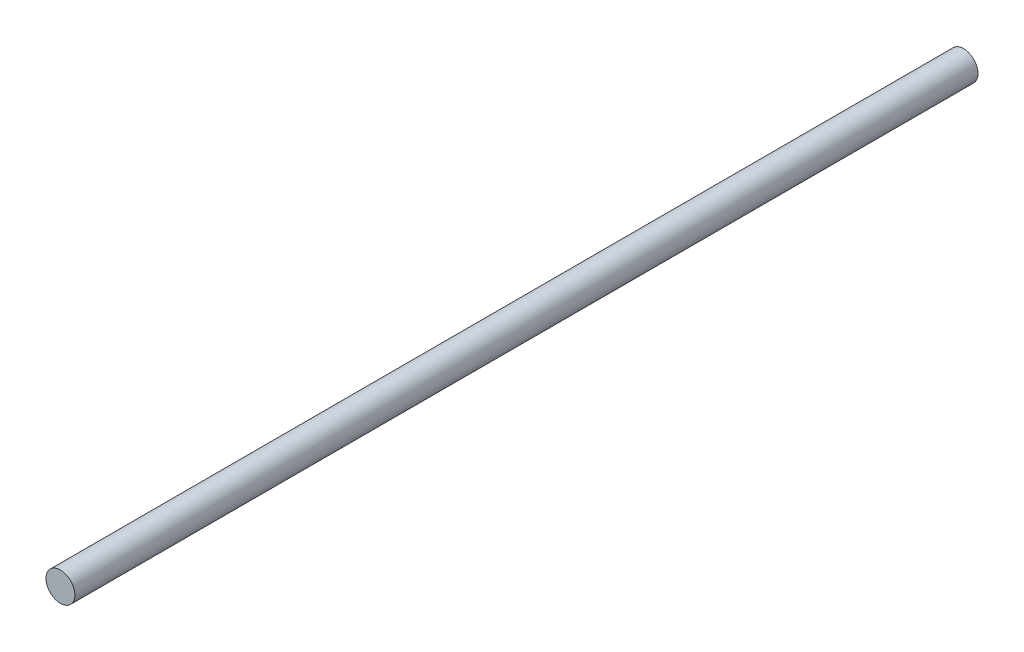
ISO-10303-21;
HEADER;
FILE_DESCRIPTION(('STEP AP214'),'2;1');
FILE_NAME('part.step','',(''),(''),'','','');
FILE_SCHEMA(('AUTOMOTIVE_DESIGN { 1 0 10303 214 1 1 1 1 }'));
ENDSEC;
DATA;
#1=APPLICATION_CONTEXT('core data for automotive mechanical design processes');
#2=APPLICATION_PROTOCOL_DEFINITION('international standard','automotive_design',2000,#1);
#3=PRODUCT_CONTEXT('',#1,'mechanical');
#4=PRODUCT('Part','Part','',(#3));
#5=PRODUCT_RELATED_PRODUCT_CATEGORY('part','',(#4));
#6=PRODUCT_DEFINITION_FORMATION('','',#4);
#7=PRODUCT_DEFINITION_CONTEXT('part definition',#1,'design');
#8=PRODUCT_DEFINITION('design','',#6,#7);
#9=PRODUCT_DEFINITION_SHAPE('','',#8);
#10=(LENGTH_UNIT() NAMED_UNIT(*) SI_UNIT(.MILLI.,.METRE.));
#11=(NAMED_UNIT(*) PLANE_ANGLE_UNIT() SI_UNIT($,.RADIAN.));
#12=(NAMED_UNIT(*) SI_UNIT($,.STERADIAN.) SOLID_ANGLE_UNIT());
#13=UNCERTAINTY_MEASURE_WITH_UNIT(LENGTH_MEASURE(1.E-05),#10,'distance_accuracy_value','');
#14=(GEOMETRIC_REPRESENTATION_CONTEXT(3) GLOBAL_UNCERTAINTY_ASSIGNED_CONTEXT((#13)) GLOBAL_UNIT_ASSIGNED_CONTEXT((#10,
#11,#12)) REPRESENTATION_CONTEXT('',''));
#15=CARTESIAN_POINT('',(0.,0.,0.));
#16=DIRECTION('',(0.,0.,1.));
#17=DIRECTION('',(1.,0.,0.));
#18=AXIS2_PLACEMENT_3D('',#15,#16,#17);
#19=CARTESIAN_POINT('',(0.,0.,250.));
#20=DIRECTION('',(0.,0.,-1.));
#21=DIRECTION('',(-1.,0.,0.));
#22=AXIS2_PLACEMENT_3D('',#19,#20,#21);
#23=CYLINDRICAL_SURFACE('',#22,4.);
#24=CARTESIAN_POINT('',(0.,0.,250.));
#25=DIRECTION('',(0.,0.,1.));
#26=DIRECTION('',(1.,0.,0.));
#27=AXIS2_PLACEMENT_3D('',#24,#25,#26);
#28=CIRCLE('',#27,4.);
#29=CARTESIAN_POINT('',(4.,0.,250.));
#30=VERTEX_POINT('',#29);
#31=EDGE_CURVE('E10',#30,#30,#28,.T.);
#32=ORIENTED_EDGE('',*,*,#31,.F.);
#33=EDGE_LOOP('',(#32));
#34=FACE_BOUND('',#33,.T.);
#35=CARTESIAN_POINT('',(0.,0.,0.));
#36=DIRECTION('',(0.,0.,1.));
#37=DIRECTION('',(1.,0.,0.));
#38=AXIS2_PLACEMENT_3D('',#35,#36,#37);
#39=CIRCLE('',#38,4.);
#40=CARTESIAN_POINT('',(4.,0.,0.));
#41=VERTEX_POINT('',#40);
#42=EDGE_CURVE('E40',#41,#41,#39,.T.);
#43=ORIENTED_EDGE('',*,*,#42,.T.);
#44=EDGE_LOOP('',(#43));
#45=FACE_BOUND('',#44,.T.);
#46=ADVANCED_FACE('F37',(#34,#45),#23,.T.);
#47=CARTESIAN_POINT('',(0.,0.,250.));
#48=DIRECTION('',(0.,0.,1.));
#49=DIRECTION('',(1.,0.,0.));
#50=AXIS2_PLACEMENT_3D('',#47,#48,#49);
#51=PLANE('',#50);
#52=ORIENTED_EDGE('',*,*,#31,.T.);
#53=EDGE_LOOP('',(#52));
#54=FACE_BOUND('',#53,.T.);
#55=ADVANCED_FACE('F54',(#54),#51,.T.);
#56=CARTESIAN_POINT('',(0.,0.,0.));
#57=DIRECTION('',(0.,0.,1.));
#58=DIRECTION('',(1.,0.,0.));
#59=AXIS2_PLACEMENT_3D('',#56,#57,#58);
#60=PLANE('',#59);
#61=ORIENTED_EDGE('',*,*,#42,.F.);
#62=EDGE_LOOP('',(#61));
#63=FACE_BOUND('',#62,.T.);
#64=ADVANCED_FACE('F52',(#63),#60,.F.);
#65=CLOSED_SHELL('',(#46,#55,#64));
#66=MANIFOLD_SOLID_BREP('B2',#65);
#67=ADVANCED_BREP_SHAPE_REPRESENTATION('',(#18,#66),#14);
#68=SHAPE_DEFINITION_REPRESENTATION(#9,#67);
ENDSEC;
END-ISO-10303-21;
